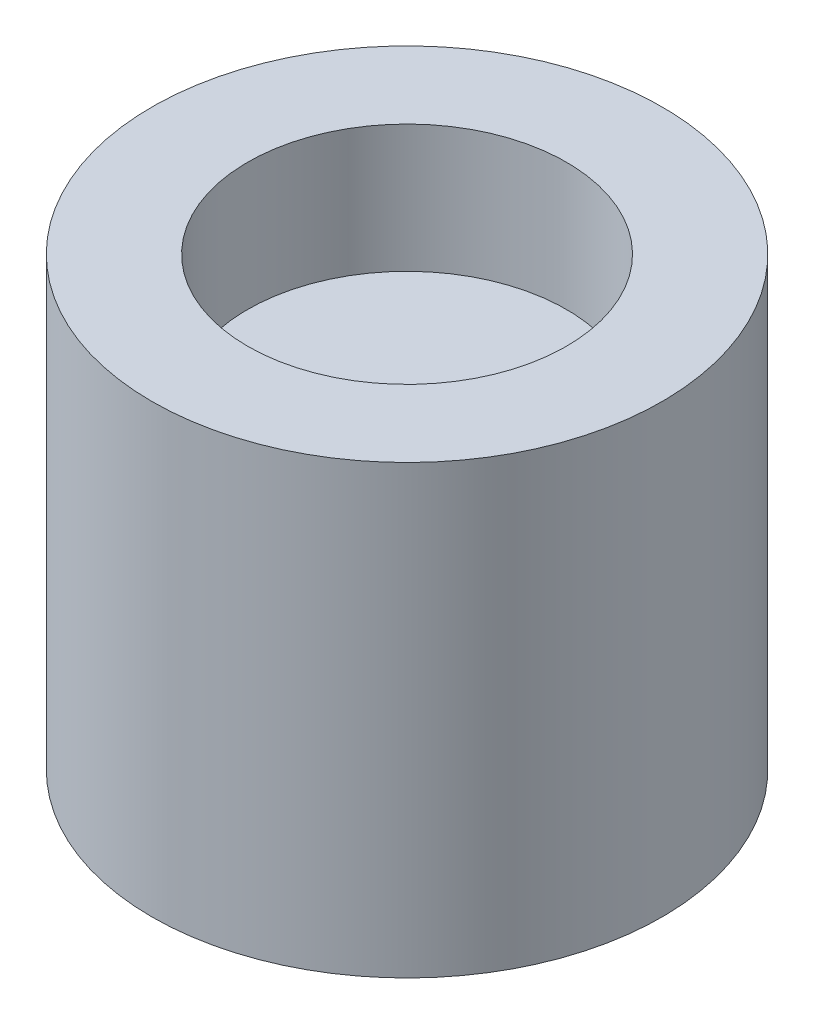
ISO-10303-21;
HEADER;
FILE_DESCRIPTION(('STEP AP214'),'2;1');
FILE_NAME('part.step','',(''),(''),'','','');
FILE_SCHEMA(('AUTOMOTIVE_DESIGN { 1 0 10303 214 1 1 1 1 }'));
ENDSEC;
DATA;
#1=APPLICATION_CONTEXT('core data for automotive mechanical design processes');
#2=APPLICATION_PROTOCOL_DEFINITION('international standard','automotive_design',2000,#1);
#3=PRODUCT_CONTEXT('',#1,'mechanical');
#4=PRODUCT('Part','Part','',(#3));
#5=PRODUCT_RELATED_PRODUCT_CATEGORY('part','',(#4));
#6=PRODUCT_DEFINITION_FORMATION('','',#4);
#7=PRODUCT_DEFINITION_CONTEXT('part definition',#1,'design');
#8=PRODUCT_DEFINITION('design','',#6,#7);
#9=PRODUCT_DEFINITION_SHAPE('','',#8);
#10=(LENGTH_UNIT() NAMED_UNIT(*) SI_UNIT(.MILLI.,.METRE.));
#11=(NAMED_UNIT(*) PLANE_ANGLE_UNIT() SI_UNIT($,.RADIAN.));
#12=(NAMED_UNIT(*) SI_UNIT($,.STERADIAN.) SOLID_ANGLE_UNIT());
#13=UNCERTAINTY_MEASURE_WITH_UNIT(LENGTH_MEASURE(1.E-05),#10,'distance_accuracy_value','');
#14=(GEOMETRIC_REPRESENTATION_CONTEXT(3) GLOBAL_UNCERTAINTY_ASSIGNED_CONTEXT((#13)) GLOBAL_UNIT_ASSIGNED_CONTEXT((#10,
#11,#12)) REPRESENTATION_CONTEXT('',''));
#15=CARTESIAN_POINT('',(0.,0.,0.));
#16=DIRECTION('',(0.,0.,1.));
#17=DIRECTION('',(1.,0.,0.));
#18=AXIS2_PLACEMENT_3D('',#15,#16,#17);
#19=CARTESIAN_POINT('',(0.,0.,0.));
#20=DIRECTION('',(0.,1.,0.));
#21=DIRECTION('',(0.,0.,1.));
#22=AXIS2_PLACEMENT_3D('',#19,#20,#21);
#23=PLANE('',#22);
#24=CARTESIAN_POINT('',(0.,0.,0.));
#25=DIRECTION('',(0.,1.,0.));
#26=DIRECTION('',(0.,0.,1.));
#27=AXIS2_PLACEMENT_3D('',#24,#25,#26);
#28=CIRCLE('',#27,5.08);
#29=CARTESIAN_POINT('',(0.,0.,5.08));
#30=VERTEX_POINT('',#29);
#31=EDGE_CURVE('E43',#30,#30,#28,.T.);
#32=ORIENTED_EDGE('',*,*,#31,.F.);
#33=EDGE_LOOP('',(#32));
#34=FACE_BOUND('',#33,.T.);
#35=CARTESIAN_POINT('',(0.,0.,0.));
#36=DIRECTION('',(0.,1.,0.));
#37=DIRECTION('',(0.,0.,1.));
#38=AXIS2_PLACEMENT_3D('',#35,#36,#37);
#39=CIRCLE('',#38,3.429);
#40=CARTESIAN_POINT('',(-2.794,0.,1.98786443199731));
#41=VERTEX_POINT('',#40);
#42=CARTESIAN_POINT('',(-2.794,0.,-1.98786443199731));
#43=VERTEX_POINT('',#42);
#44=EDGE_CURVE('E55',#41,#43,#39,.T.);
#45=ORIENTED_EDGE('',*,*,#44,.T.);
#46=DIRECTION('',(0.,0.,-1.));
#47=VECTOR('',#46,1.);
#48=CARTESIAN_POINT('',(-2.794,0.,0.));
#49=LINE('',#48,#47);
#50=EDGE_CURVE('E75',#41,#43,#49,.T.);
#51=ORIENTED_EDGE('',*,*,#50,.F.);
#52=EDGE_LOOP('',(#45,#51));
#53=FACE_BOUND('',#52,.T.);
#54=ADVANCED_FACE('F39',(#34,#53),#23,.F.);
#55=CARTESIAN_POINT('',(0.,8.89,0.));
#56=DIRECTION('',(0.,-1.,0.));
#57=DIRECTION('',(0.,0.,-1.));
#58=AXIS2_PLACEMENT_3D('',#55,#56,#57);
#59=CYLINDRICAL_SURFACE('',#58,5.08);
#60=CARTESIAN_POINT('',(0.,8.89,0.));
#61=DIRECTION('',(0.,1.,0.));
#62=DIRECTION('',(0.,0.,1.));
#63=AXIS2_PLACEMENT_3D('',#60,#61,#62);
#64=CIRCLE('',#63,5.08);
#65=CARTESIAN_POINT('',(0.,8.89,5.08));
#66=VERTEX_POINT('',#65);
#67=EDGE_CURVE('E11',#66,#66,#64,.T.);
#68=ORIENTED_EDGE('',*,*,#67,.F.);
#69=EDGE_LOOP('',(#68));
#70=FACE_BOUND('',#69,.T.);
#71=ORIENTED_EDGE('',*,*,#31,.T.);
#72=EDGE_LOOP('',(#71));
#73=FACE_BOUND('',#72,.T.);
#74=ADVANCED_FACE('F41',(#70,#73),#59,.T.);
#75=CARTESIAN_POINT('',(0.,8.89,0.));
#76=DIRECTION('',(0.,1.,0.));
#77=DIRECTION('',(0.,0.,1.));
#78=AXIS2_PLACEMENT_3D('',#75,#76,#77);
#79=PLANE('',#78);
#80=CARTESIAN_POINT('',(0.,8.89,0.));
#81=DIRECTION('',(0.,1.,0.));
#82=DIRECTION('',(0.,0.,1.));
#83=AXIS2_PLACEMENT_3D('',#80,#81,#82);
#84=CIRCLE('',#83,3.175);
#85=CARTESIAN_POINT('',(0.,8.89,3.175));
#86=VERTEX_POINT('',#85);
#87=EDGE_CURVE('E85',#86,#86,#84,.T.);
#88=ORIENTED_EDGE('',*,*,#87,.F.);
#89=EDGE_LOOP('',(#88));
#90=FACE_BOUND('',#89,.T.);
#91=ORIENTED_EDGE('',*,*,#67,.T.);
#92=EDGE_LOOP('',(#91));
#93=FACE_BOUND('',#92,.T.);
#94=ADVANCED_FACE('F102',(#90,#93),#79,.T.);
#95=CARTESIAN_POINT('',(0.,3.81,0.));
#96=DIRECTION('',(0.,-1.,0.));
#97=DIRECTION('',(0.,0.,-1.));
#98=AXIS2_PLACEMENT_3D('',#95,#96,#97);
#99=CYLINDRICAL_SURFACE('',#98,3.429);
#100=ORIENTED_EDGE('',*,*,#44,.F.);
#101=DIRECTION('',(0.,-1.,0.));
#102=VECTOR('',#101,1.);
#103=CARTESIAN_POINT('',(-2.794,3.81,1.98786443199731));
#104=LINE('',#103,#102);
#105=CARTESIAN_POINT('',(-2.794,3.81,1.98786443199731));
#106=VERTEX_POINT('',#105);
#107=EDGE_CURVE('E60',#106,#41,#104,.T.);
#108=ORIENTED_EDGE('',*,*,#107,.F.);
#109=CARTESIAN_POINT('',(0.,3.81,0.));
#110=DIRECTION('',(0.,1.,0.));
#111=DIRECTION('',(0.,0.,1.));
#112=AXIS2_PLACEMENT_3D('',#109,#110,#111);
#113=CIRCLE('',#112,3.429);
#114=CARTESIAN_POINT('',(-2.794,3.81,-1.98786443199731));
#115=VERTEX_POINT('',#114);
#116=EDGE_CURVE('E68',#106,#115,#113,.T.);
#117=ORIENTED_EDGE('',*,*,#116,.T.);
#118=DIRECTION('',(0.,-1.,0.));
#119=VECTOR('',#118,1.);
#120=CARTESIAN_POINT('',(-2.794,3.81,-1.98786443199731));
#121=LINE('',#120,#119);
#122=EDGE_CURVE('E65',#115,#43,#121,.T.);
#123=ORIENTED_EDGE('',*,*,#122,.T.);
#124=EDGE_LOOP('',(#100,#108,#117,#123));
#125=FACE_BOUND('',#124,.T.);
#126=ADVANCED_FACE('F67',(#125),#99,.F.);
#127=CARTESIAN_POINT('',(-2.794,3.81,0.));
#128=DIRECTION('',(-1.,0.,0.));
#129=DIRECTION('',(0.,0.,1.));
#130=AXIS2_PLACEMENT_3D('',#127,#128,#129);
#131=PLANE('',#130);
#132=ORIENTED_EDGE('',*,*,#50,.T.);
#133=ORIENTED_EDGE('',*,*,#122,.F.);
#134=DIRECTION('',(0.,0.,-1.));
#135=VECTOR('',#134,1.);
#136=CARTESIAN_POINT('',(-2.794,3.81,0.));
#137=LINE('',#136,#135);
#138=EDGE_CURVE('E88',#106,#115,#137,.T.);
#139=ORIENTED_EDGE('',*,*,#138,.F.);
#140=ORIENTED_EDGE('',*,*,#107,.T.);
#141=EDGE_LOOP('',(#132,#133,#139,#140));
#142=FACE_BOUND('',#141,.T.);
#143=ADVANCED_FACE('F76',(#142),#131,.F.);
#144=CARTESIAN_POINT('',(0.,3.81,0.));
#145=DIRECTION('',(0.,1.,0.));
#146=DIRECTION('',(0.,0.,1.));
#147=AXIS2_PLACEMENT_3D('',#144,#145,#146);
#148=PLANE('',#147);
#149=ORIENTED_EDGE('',*,*,#116,.F.);
#150=ORIENTED_EDGE('',*,*,#138,.T.);
#151=EDGE_LOOP('',(#149,#150));
#152=FACE_BOUND('',#151,.T.);
#153=ADVANCED_FACE('F122',(#152),#148,.F.);
#154=CARTESIAN_POINT('',(0.,6.35,0.));
#155=DIRECTION('',(0.,1.,0.));
#156=DIRECTION('',(0.,0.,1.));
#157=AXIS2_PLACEMENT_3D('',#154,#155,#156);
#158=CYLINDRICAL_SURFACE('',#157,3.175);
#159=CARTESIAN_POINT('',(0.,6.35,0.));
#160=DIRECTION('',(0.,1.,0.));
#161=DIRECTION('',(0.,0.,1.));
#162=AXIS2_PLACEMENT_3D('',#159,#160,#161);
#163=CIRCLE('',#162,3.175);
#164=CARTESIAN_POINT('',(0.,6.35,3.175));
#165=VERTEX_POINT('',#164);
#166=EDGE_CURVE('E81',#165,#165,#163,.T.);
#167=ORIENTED_EDGE('',*,*,#166,.F.);
#168=EDGE_LOOP('',(#167));
#169=FACE_BOUND('',#168,.T.);
#170=ORIENTED_EDGE('',*,*,#87,.T.);
#171=EDGE_LOOP('',(#170));
#172=FACE_BOUND('',#171,.T.);
#173=ADVANCED_FACE('F100',(#169,#172),#158,.F.);
#174=CARTESIAN_POINT('',(0.,6.35,0.));
#175=DIRECTION('',(0.,1.,0.));
#176=DIRECTION('',(0.,0.,1.));
#177=AXIS2_PLACEMENT_3D('',#174,#175,#176);
#178=PLANE('',#177);
#179=ORIENTED_EDGE('',*,*,#166,.T.);
#180=EDGE_LOOP('',(#179));
#181=FACE_BOUND('',#180,.T.);
#182=ADVANCED_FACE('F127',(#181),#178,.T.);
#183=CLOSED_SHELL('',(#54,#74,#94,#126,#143,#153,#173,#182));
#184=MANIFOLD_SOLID_BREP('B2',#183);
#185=ADVANCED_BREP_SHAPE_REPRESENTATION('',(#18,#184),#14);
#186=SHAPE_DEFINITION_REPRESENTATION(#9,#185);
ENDSEC;
END-ISO-10303-21;
